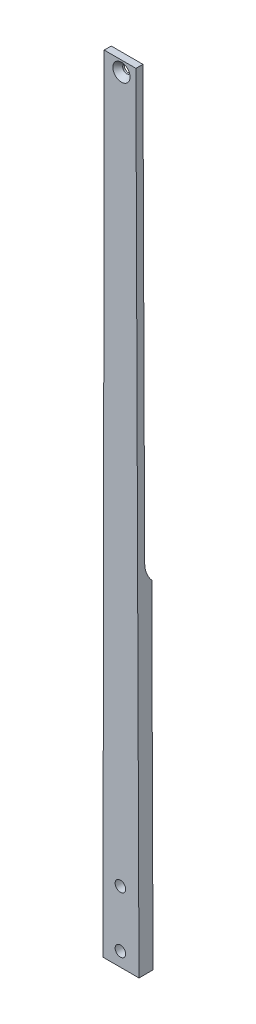
ISO-10303-21;
HEADER;
FILE_DESCRIPTION(('STEP AP214'),'2;1');
FILE_NAME('part.step','',(''),(''),'','','');
FILE_SCHEMA(('AUTOMOTIVE_DESIGN { 1 0 10303 214 1 1 1 1 }'));
ENDSEC;
DATA;
#1=APPLICATION_CONTEXT('core data for automotive mechanical design processes');
#2=APPLICATION_PROTOCOL_DEFINITION('international standard','automotive_design',2000,#1);
#3=PRODUCT_CONTEXT('',#1,'mechanical');
#4=PRODUCT('Part','Part','',(#3));
#5=PRODUCT_RELATED_PRODUCT_CATEGORY('part','',(#4));
#6=PRODUCT_DEFINITION_FORMATION('','',#4);
#7=PRODUCT_DEFINITION_CONTEXT('part definition',#1,'design');
#8=PRODUCT_DEFINITION('design','',#6,#7);
#9=PRODUCT_DEFINITION_SHAPE('','',#8);
#10=(LENGTH_UNIT() NAMED_UNIT(*) SI_UNIT(.MILLI.,.METRE.));
#11=(NAMED_UNIT(*) PLANE_ANGLE_UNIT() SI_UNIT($,.RADIAN.));
#12=(NAMED_UNIT(*) SI_UNIT($,.STERADIAN.) SOLID_ANGLE_UNIT());
#13=UNCERTAINTY_MEASURE_WITH_UNIT(LENGTH_MEASURE(1.E-05),#10,'distance_accuracy_value','');
#14=(GEOMETRIC_REPRESENTATION_CONTEXT(3) GLOBAL_UNCERTAINTY_ASSIGNED_CONTEXT((#13)) GLOBAL_UNIT_ASSIGNED_CONTEXT((#10,
#11,#12)) REPRESENTATION_CONTEXT('',''));
#15=CARTESIAN_POINT('',(0.,0.,0.));
#16=DIRECTION('',(0.,0.,1.));
#17=DIRECTION('',(1.,0.,0.));
#18=AXIS2_PLACEMENT_3D('',#15,#16,#17);
#19=CARTESIAN_POINT('',(-5.28708449601715,399.996,-6.35));
#20=DIRECTION('',(0.,-1.,0.));
#21=DIRECTION('',(1.,0.,0.));
#22=AXIS2_PLACEMENT_3D('',#19,#20,#21);
#23=PLANE('',#22);
#24=DIRECTION('',(-1.,0.,0.));
#25=VECTOR('',#24,1.);
#26=CARTESIAN_POINT('',(-35.5509106008114,399.996,-3.175));
#27=LINE('',#26,#25);
#28=CARTESIAN_POINT('',(9.04641692880041,399.996,-3.175));
#29=VERTEX_POINT('',#28);
#30=CARTESIAN_POINT('',(-5.28708449601715,399.996,-3.175));
#31=VERTEX_POINT('',#30);
#32=EDGE_CURVE('E102',#29,#31,#27,.T.);
#33=ORIENTED_EDGE('',*,*,#32,.T.);
#34=DIRECTION('',(0.,0.,1.));
#35=VECTOR('',#34,1.);
#36=CARTESIAN_POINT('',(-5.28708449601715,399.996,-6.35));
#37=LINE('',#36,#35);
#38=CARTESIAN_POINT('',(-5.28708449601715,399.996,0.));
#39=VERTEX_POINT('',#38);
#40=EDGE_CURVE('E111',#31,#39,#37,.T.);
#41=ORIENTED_EDGE('',*,*,#40,.T.);
#42=DIRECTION('',(-1.,0.,0.));
#43=VECTOR('',#42,1.);
#44=CARTESIAN_POINT('',(-5.28708449601715,399.996,0.));
#45=LINE('',#44,#43);
#46=CARTESIAN_POINT('',(9.04641692880041,399.996,0.));
#47=VERTEX_POINT('',#46);
#48=EDGE_CURVE('E114',#47,#39,#45,.T.);
#49=ORIENTED_EDGE('',*,*,#48,.F.);
#50=DIRECTION('',(0.,0.,1.));
#51=VECTOR('',#50,1.);
#52=CARTESIAN_POINT('',(9.04641692880041,399.996,-6.35));
#53=LINE('',#52,#51);
#54=EDGE_CURVE('E150',#29,#47,#53,.T.);
#55=ORIENTED_EDGE('',*,*,#54,.F.);
#56=EDGE_LOOP('',(#33,#41,#49,#55));
#57=FACE_BOUND('',#56,.T.);
#58=ADVANCED_FACE('F37',(#57),#23,.F.);
#59=CARTESIAN_POINT('',(2.51217831596574,395.2335,0.));
#60=DIRECTION('',(0.,0.,1.));
#61=DIRECTION('',(-1.,0.,0.));
#62=AXIS2_PLACEMENT_3D('',#59,#60,#61);
#63=CYLINDRICAL_SURFACE('',#62,1.8288);
#64=CARTESIAN_POINT('',(2.51217831596574,395.2335,-2.38137763978821));
#65=DIRECTION('',(0.,0.,-1.));
#66=DIRECTION('',(-1.,0.,0.));
#67=AXIS2_PLACEMENT_3D('',#64,#65,#66);
#68=CIRCLE('',#67,1.8288);
#69=CARTESIAN_POINT('',(0.683378315965738,395.2335,-2.38137763978821));
#70=VERTEX_POINT('',#69);
#71=EDGE_CURVE('E182',#70,#70,#68,.T.);
#72=ORIENTED_EDGE('',*,*,#71,.F.);
#73=EDGE_LOOP('',(#72));
#74=FACE_BOUND('',#73,.T.);
#75=CARTESIAN_POINT('',(2.51217831596574,395.2335,-3.175));
#76=DIRECTION('',(0.,0.,1.));
#77=DIRECTION('',(1.,0.,0.));
#78=AXIS2_PLACEMENT_3D('',#75,#76,#77);
#79=CIRCLE('',#78,1.8288);
#80=CARTESIAN_POINT('',(4.34097831596574,395.2335,-3.175));
#81=VERTEX_POINT('',#80);
#82=EDGE_CURVE('E140',#81,#81,#79,.F.);
#83=ORIENTED_EDGE('',*,*,#82,.T.);
#84=EDGE_LOOP('',(#83));
#85=FACE_BOUND('',#84,.T.);
#86=ADVANCED_FACE('F132',(#74,#85),#63,.F.);
#87=CARTESIAN_POINT('',(10.4977022260614,29.9643245872979,-6.35));
#88=CARTESIAN_POINT('',(10.3579391680048,67.7989887250294,-6.35));
#89=CARTESIAN_POINT('',(10.0201544794482,157.80257599493,-6.35));
#90=CARTESIAN_POINT('',(9.66771500819669,247.806107418328,-6.35));
#91=CARTESIAN_POINT('',(9.3229525056798,333.315331774466,-6.35));
#92=CARTESIAN_POINT('',(9.18606411784086,366.655671710222,-6.35));
#93=CARTESIAN_POINT('',(9.04641692880041,399.996,-6.35));
#94=B_SPLINE_CURVE_WITH_KNOTS('',3,(#87,#88,#89,#90,#91,#92,#93),.UNSPECIFIED.,.F.,.F.,(4,1,2,
4),(0.,0.306741017504105,0.729695864545239,1.),.UNSPECIFIED.);
#95=DIRECTION('',(0.,0.,1.));
#96=VECTOR('',#95,1.);
#97=SURFACE_OF_LINEAR_EXTRUSION('',#94,#96);
#98=CARTESIAN_POINT('',(10.4977022260614,29.9643245872979,-3.175));
#99=CARTESIAN_POINT('',(10.3579391680048,67.7989887250294,-3.175));
#100=CARTESIAN_POINT('',(10.0201544794482,157.80257599493,-3.175));
#101=CARTESIAN_POINT('',(9.66771500819669,247.806107418328,-3.175));
#102=CARTESIAN_POINT('',(9.3229525056798,333.315331774466,-3.175));
#103=CARTESIAN_POINT('',(9.18606411784086,366.655671710222,-3.175));
#104=CARTESIAN_POINT('',(9.04641692880041,399.996,-3.175));
#105=B_SPLINE_CURVE_WITH_KNOTS('',3,(#98,#99,#100,#101,#102,#103,#104),.UNSPECIFIED.,.F.,.F.,(4,
1,2,4),(0.,0.306741017504105,0.729695864545239,1.),.UNSPECIFIED.);
#106=CARTESIAN_POINT('',(9.83310345516962,205.19626041263,-3.175));
#107=VERTEX_POINT('',#106);
#108=EDGE_CURVE('E188',#107,#29,#105,.T.);
#109=ORIENTED_EDGE('',*,*,#108,.T.);
#110=ORIENTED_EDGE('',*,*,#54,.T.);
#111=CARTESIAN_POINT('',(10.4977022260614,29.9643245872979,0.));
#112=CARTESIAN_POINT('',(10.3579391680048,67.7989887250294,0.));
#113=CARTESIAN_POINT('',(10.0201544794482,157.80257599493,0.));
#114=CARTESIAN_POINT('',(9.66771500819669,247.806107418328,0.));
#115=CARTESIAN_POINT('',(9.3229525056798,333.315331774466,0.));
#116=CARTESIAN_POINT('',(9.18606411784086,366.655671710222,0.));
#117=CARTESIAN_POINT('',(9.04641692880041,399.996,0.));
#118=B_SPLINE_CURVE_WITH_KNOTS('',3,(#111,#112,#113,#114,#115,#116,#117),.UNSPECIFIED.,.F.,.F.,
(4,1,2,4),(0.,0.306741017504105,0.729695864545239,1.),.UNSPECIFIED.);
#119=CARTESIAN_POINT('',(10.4440816928599,44.45,0.));
#120=VERTEX_POINT('',#119);
#121=EDGE_CURVE('E161',#120,#47,#118,.T.);
#122=ORIENTED_EDGE('',*,*,#121,.F.);
#123=DIRECTION('',(0.,0.,1.));
#124=VECTOR('',#123,1.);
#125=CARTESIAN_POINT('',(10.4440816928599,44.45,-6.35));
#126=LINE('',#125,#124);
#127=CARTESIAN_POINT('',(10.4440816928599,44.45,-6.35));
#128=VERTEX_POINT('',#127);
#129=EDGE_CURVE('E108',#128,#120,#126,.T.);
#130=ORIENTED_EDGE('',*,*,#129,.F.);
#131=CARTESIAN_POINT('',(9.86581217806057,196.796,-6.35));
#132=VERTEX_POINT('',#131);
#133=EDGE_CURVE('E97',#128,#132,#94,.T.);
#134=ORIENTED_EDGE('',*,*,#133,.T.);
#135=CARTESIAN_POINT('',(9.83310345513582,205.19626041263,-3.175));
#136=CARTESIAN_POINT('',(9.83403087909923,204.958415509531,-3.17499247087948));
#137=CARTESIAN_POINT('',(9.83495818721562,204.720571438755,-3.18168124047176));
#138=CARTESIAN_POINT('',(9.83680965387325,204.245634259718,-3.20839712795122));
#139=CARTESIAN_POINT('',(9.83773381242488,204.008541148978,-3.2284242017747));
#140=CARTESIAN_POINT('',(9.83957607416271,203.535852086352,-3.28176262079115));
#141=CARTESIAN_POINT('',(9.84049417730992,203.300256144104,-3.3150740514291));
#142=CARTESIAN_POINT('',(9.84232291490128,202.830925481324,-3.3949381616698));
#143=CARTESIAN_POINT('',(9.84323353475041,202.597194415948,-3.44151231306713));
#144=CARTESIAN_POINT('',(9.84504290061525,202.132725845167,-3.54773335974519));
#145=CARTESIAN_POINT('',(9.84594164701047,201.901988244092,-3.60737983613853));
#146=CARTESIAN_POINT('',(9.84772435028309,201.444257575011,-3.739546412053));
#147=CARTESIAN_POINT('',(9.84860830790293,201.21726431904,-3.81206586318933));
#148=CARTESIAN_POINT('',(9.85079718801886,200.655114239211,-4.00926167887641));
#149=CARTESIAN_POINT('',(9.85209128762189,200.322705029697,-4.14187272721175));
#150=CARTESIAN_POINT('',(9.8546309599013,199.670246150278,-4.43467368466598));
#151=CARTESIAN_POINT('',(9.8558765267388,199.350197967542,-4.59486689965228));
#152=CARTESIAN_POINT('',(9.85830705469773,198.725578126764,-4.94122304297471));
#153=CARTESIAN_POINT('',(9.8594921651959,198.420968336657,-5.12731725725638));
#154=CARTESIAN_POINT('',(9.86179638689621,197.828626729997,-5.52439724126177));
#155=CARTESIAN_POINT('',(9.86291553916851,197.540884411198,-5.73536727064338));
#156=CARTESIAN_POINT('',(9.86430631255106,197.18325794127,-6.02146583437368));
#157=CARTESIAN_POINT('',(9.86461192092945,197.104669978291,-6.08589897004978));
#158=CARTESIAN_POINT('',(9.86521677953916,196.94912305434,-6.21658257289285));
#159=CARTESIAN_POINT('',(9.86551603448512,196.872162885615,-6.28283160249194));
#160=CARTESIAN_POINT('',(9.86581217806057,196.796,-6.34999999999999));
#161=B_SPLINE_CURVE_WITH_KNOTS('',3,(#135,#136,#137,#138,#139,#140,#141,#142,#143,#144,#145,
#146,#147,#148,#149,#150,#151,#152,#153,#154,#155,#156,#157,#158,#159,#160),.UNSPECIFIED.,.F.,
.F.,(4,2,2,2,2,2,2,2,2,2,2,2,4),(0.,0.713444861550316,1.42688736621422,2.14033445981421,
2.85494322615147,3.56952909703283,4.28407898592627,5.35639076364407,6.42883115313344,
7.49847880061246,8.56745321710063,8.87231133920578,9.17693471733898),.UNSPECIFIED.);
#162=EDGE_CURVE('E51',#107,#132,#161,.T.);
#163=ORIENTED_EDGE('',*,*,#162,.F.);
#164=EDGE_LOOP('',(#109,#110,#122,#130,#134,#163));
#165=FACE_BOUND('',#164,.T.);
#166=ADVANCED_FACE('F105',(#165),#97,.T.);
#167=CARTESIAN_POINT('',(-5.28708449601715,399.996,-6.35));
#168=CARTESIAN_POINT('',(-5.39197549250737,338.602231380514,-6.35));
#169=CARTESIAN_POINT('',(-5.52953849339023,254.095503007995,-6.35));
#170=CARTESIAN_POINT('',(-5.71814315412126,131.164770272772,-6.35));
#171=CARTESIAN_POINT('',(-5.80863152532558,69.6278175841326,-6.35));
#172=CARTESIAN_POINT('',(-5.86379750654596,31.2038199392675,-6.35));
#173=B_SPLINE_CURVE_WITH_KNOTS('',3,(#167,#168,#169,#170,#171,#172),.UNSPECIFIED.,.F.,.F.,(4,1,
1,4),(0.,0.499417717587248,0.68743379950888,1.),.UNSPECIFIED.);
#174=DIRECTION('',(0.,0.,1.));
#175=VECTOR('',#174,1.);
#176=SURFACE_OF_LINEAR_EXTRUSION('',#173,#175);
#177=CARTESIAN_POINT('',(-5.61721184025603,196.796,-6.35));
#178=VERTEX_POINT('',#177);
#179=CARTESIAN_POINT('',(-5.84472654488417,44.45,-6.35));
#180=VERTEX_POINT('',#179);
#181=EDGE_CURVE('E100',#178,#180,#173,.T.);
#182=ORIENTED_EDGE('',*,*,#181,.T.);
#183=DIRECTION('',(0.,0.,1.));
#184=VECTOR('',#183,1.);
#185=CARTESIAN_POINT('',(-5.84472654488613,44.45,-6.35));
#186=LINE('',#185,#184);
#187=CARTESIAN_POINT('',(-5.84472654488417,44.4500000013556,0.));
#188=VERTEX_POINT('',#187);
#189=EDGE_CURVE('E168',#188,#180,#186,.F.);
#190=ORIENTED_EDGE('',*,*,#189,.F.);
#191=CARTESIAN_POINT('',(-5.28708449601715,399.996,0.));
#192=CARTESIAN_POINT('',(-5.39197549250737,338.602231380514,0.));
#193=CARTESIAN_POINT('',(-5.52953849339023,254.095503007995,0.));
#194=CARTESIAN_POINT('',(-5.71814315412126,131.164770272772,0.));
#195=CARTESIAN_POINT('',(-5.80863152532558,69.6278175841326,0.));
#196=CARTESIAN_POINT('',(-5.86379750654596,31.2038199392675,0.));
#197=B_SPLINE_CURVE_WITH_KNOTS('',3,(#191,#192,#193,#194,#195,#196),.UNSPECIFIED.,.F.,.F.,(4,1,
1,4),(0.,0.499417717587248,0.68743379950888,1.),.UNSPECIFIED.);
#198=EDGE_CURVE('E109',#39,#188,#197,.T.);
#199=ORIENTED_EDGE('',*,*,#198,.F.);
#200=ORIENTED_EDGE('',*,*,#40,.F.);
#201=CARTESIAN_POINT('',(-5.28708449601715,399.996,-3.175));
#202=CARTESIAN_POINT('',(-5.39197549250737,338.602231380514,-3.175));
#203=CARTESIAN_POINT('',(-5.52953849339023,254.095503007995,-3.175));
#204=CARTESIAN_POINT('',(-5.71814315412126,131.164770272772,-3.175));
#205=CARTESIAN_POINT('',(-5.80863152532558,69.6278175841326,-3.175));
#206=CARTESIAN_POINT('',(-5.86379750654596,31.2038199392675,-3.175));
#207=B_SPLINE_CURVE_WITH_KNOTS('',3,(#201,#202,#203,#204,#205,#206),.UNSPECIFIED.,.F.,.F.,(4,1,
1,4),(0.,0.499417717587248,0.68743379950888,1.),.UNSPECIFIED.);
#208=CARTESIAN_POINT('',(-5.60420008435778,205.19626041263,-3.175));
#209=VERTEX_POINT('',#208);
#210=EDGE_CURVE('E143',#31,#209,#207,.T.);
#211=ORIENTED_EDGE('',*,*,#210,.T.);
#212=CARTESIAN_POINT('',(-5.61721184025603,196.796,-6.35));
#213=CARTESIAN_POINT('',(-5.61693608310515,196.974377902398,-6.19267543773624));
#214=CARTESIAN_POINT('',(-5.61665344504512,197.157184320282,-6.040373611593));
#215=CARTESIAN_POINT('',(-5.61607532162393,197.531056323594,-5.74627035829035));
#216=CARTESIAN_POINT('',(-5.61577983630551,197.722121881548,-5.60446889620736));
#217=CARTESIAN_POINT('',(-5.61517692910145,198.111916748259,-5.33181936933783));
#218=CARTESIAN_POINT('',(-5.61486950713914,198.310646106244,-5.20097137492866));
#219=CARTESIAN_POINT('',(-5.61424318352235,198.715466996848,-4.95043735737793));
#220=CARTESIAN_POINT('',(-5.61392426399462,198.921569987803,-4.83076985173149));
#221=CARTESIAN_POINT('',(-5.61327642223252,199.340177499266,-4.60321934396371));
#222=CARTESIAN_POINT('',(-5.61294750031891,199.552681814496,-4.49533596446133));
#223=CARTESIAN_POINT('',(-5.61228072099003,199.983397037189,-4.29170108053239));
#224=CARTESIAN_POINT('',(-5.61194286402551,200.201607656775,-4.19594896551751));
#225=CARTESIAN_POINT('',(-5.61108799952469,200.75364923563,-3.97201890979975));
#226=CARTESIAN_POINT('',(-5.61056598922691,201.09066771392,-3.85160927357716));
#227=CARTESIAN_POINT('',(-5.60950781325277,201.773676479233,-3.63964886696507));
#228=CARTESIAN_POINT('',(-5.60897164588608,202.119667837519,-3.5481015597469));
#229=CARTESIAN_POINT('',(-5.6078904103516,202.817220356157,-3.39472057993135));
#230=CARTESIAN_POINT('',(-5.60734536899653,203.168764667031,-3.33281015533952));
#231=CARTESIAN_POINT('',(-5.60624911012439,203.875658851902,-3.23882126083724));
#232=CARTESIAN_POINT('',(-5.60569789671033,204.23100619153,-3.20672404002061));
#233=CARTESIAN_POINT('',(-5.60498810424915,204.688468214795,-3.18474810991549));
#234=CARTESIAN_POINT('',(-5.60483050086139,204.79003647606,-3.18109127846491));
#235=CARTESIAN_POINT('',(-5.60451530205358,204.993153280969,-3.17621852005121));
#236=CARTESIAN_POINT('',(-5.60435770672086,205.094701779563,-3.17500071554446));
#237=CARTESIAN_POINT('',(-5.60420008435778,205.19626041263,-3.175));
#238=B_SPLINE_CURVE_WITH_KNOTS('',3,(#212,#213,#214,#215,#216,#217,#218,#219,#220,#221,#222,
#223,#224,#225,#226,#227,#228,#229,#230,#231,#232,#233,#234,#235,#236,#237),.UNSPECIFIED.,.F.,
.F.,(4,2,2,2,2,2,2,2,2,2,2,2,4),(0.,0.713436737987538,1.42687110302095,2.14031005160588,
2.85491041775407,3.56948789245234,4.28402938688344,5.35632844479902,6.42875611822762,
7.49839124665395,8.56735317551277,8.87223665778535,9.17688535282129),.UNSPECIFIED.);
#239=EDGE_CURVE('E11',#178,#209,#238,.T.);
#240=ORIENTED_EDGE('',*,*,#239,.F.);
#241=EDGE_LOOP('',(#182,#190,#199,#200,#211,#240));
#242=FACE_BOUND('',#241,.T.);
#243=ADVANCED_FACE('F131',(#242),#176,.T.);
#244=CARTESIAN_POINT('',(9.7948897232855,214.980252046994,-6.35));
#245=DIRECTION('',(0.,0.,1.));
#246=DIRECTION('',(-1.,0.,0.));
#247=AXIS2_PLACEMENT_3D('',#244,#245,#246);
#248=PLANE('',#247);
#249=CARTESIAN_POINT('',(2.032,50.8,-6.35));
#250=DIRECTION('',(0.,0.,1.));
#251=DIRECTION('',(1.,0.,0.));
#252=AXIS2_PLACEMENT_3D('',#249,#250,#251);
#253=CIRCLE('',#252,2.38125);
#254=CARTESIAN_POINT('',(4.41325,50.8,-6.35));
#255=VERTEX_POINT('',#254);
#256=EDGE_CURVE('E179',#255,#255,#253,.T.);
#257=ORIENTED_EDGE('',*,*,#256,.T.);
#258=EDGE_LOOP('',(#257));
#259=FACE_BOUND('',#258,.T.);
#260=CARTESIAN_POINT('',(2.03199999999999,76.2,-6.35));
#261=DIRECTION('',(0.,0.,1.));
#262=DIRECTION('',(1.,0.,0.));
#263=AXIS2_PLACEMENT_3D('',#260,#261,#262);
#264=CIRCLE('',#263,2.38125);
#265=CARTESIAN_POINT('',(4.41324999999999,76.2,-6.35));
#266=VERTEX_POINT('',#265);
#267=EDGE_CURVE('E148',#266,#266,#264,.T.);
#268=ORIENTED_EDGE('',*,*,#267,.T.);
#269=EDGE_LOOP('',(#268));
#270=FACE_BOUND('',#269,.T.);
#271=ORIENTED_EDGE('',*,*,#133,.F.);
#272=DIRECTION('',(-1.,0.,0.));
#273=VECTOR('',#272,1.);
#274=CARTESIAN_POINT('',(-9.398,44.45,-6.35));
#275=LINE('',#274,#273);
#276=EDGE_CURVE('E147',#128,#180,#275,.T.);
#277=ORIENTED_EDGE('',*,*,#276,.T.);
#278=ORIENTED_EDGE('',*,*,#181,.F.);
#279=DIRECTION('',(1.,0.,0.));
#280=VECTOR('',#279,1.);
#281=CARTESIAN_POINT('',(-35.5509106008114,196.796,-6.35));
#282=LINE('',#281,#280);
#283=EDGE_CURVE('E94',#178,#132,#282,.T.);
#284=ORIENTED_EDGE('',*,*,#283,.T.);
#285=EDGE_LOOP('',(#271,#277,#278,#284));
#286=FACE_BOUND('',#285,.T.);
#287=ADVANCED_FACE('F95',(#259,#270,#286),#248,.F.);
#288=CARTESIAN_POINT('',(9.7948897232855,214.980252046994,0.));
#289=DIRECTION('',(0.,0.,1.));
#290=DIRECTION('',(-1.,0.,0.));
#291=AXIS2_PLACEMENT_3D('',#288,#289,#290);
#292=PLANE('',#291);
#293=CARTESIAN_POINT('',(2.51217831596574,395.2335,0.));
#294=DIRECTION('',(0.,0.,-1.));
#295=DIRECTION('',(-1.,0.,0.));
#296=AXIS2_PLACEMENT_3D('',#293,#294,#295);
#297=CIRCLE('',#296,3.8989);
#298=CARTESIAN_POINT('',(-1.38672168403426,395.2335,0.));
#299=VERTEX_POINT('',#298);
#300=EDGE_CURVE('E185',#299,#299,#297,.T.);
#301=ORIENTED_EDGE('',*,*,#300,.T.);
#302=EDGE_LOOP('',(#301));
#303=FACE_BOUND('',#302,.T.);
#304=CARTESIAN_POINT('',(2.032,50.8,0.));
#305=DIRECTION('',(0.,0.,-1.));
#306=DIRECTION('',(-1.,0.,0.));
#307=AXIS2_PLACEMENT_3D('',#304,#305,#306);
#308=CIRCLE('',#307,2.38125);
#309=CARTESIAN_POINT('',(-0.349249999999997,50.8,0.));
#310=VERTEX_POINT('',#309);
#311=EDGE_CURVE('E176',#310,#310,#308,.T.);
#312=ORIENTED_EDGE('',*,*,#311,.T.);
#313=EDGE_LOOP('',(#312));
#314=FACE_BOUND('',#313,.T.);
#315=CARTESIAN_POINT('',(2.03199999999999,76.2,0.));
#316=DIRECTION('',(0.,0.,-1.));
#317=DIRECTION('',(-1.,0.,0.));
#318=AXIS2_PLACEMENT_3D('',#315,#316,#317);
#319=CIRCLE('',#318,2.38125);
#320=CARTESIAN_POINT('',(-0.349250000000003,76.2,0.));
#321=VERTEX_POINT('',#320);
#322=EDGE_CURVE('E144',#321,#321,#319,.T.);
#323=ORIENTED_EDGE('',*,*,#322,.T.);
#324=EDGE_LOOP('',(#323));
#325=FACE_BOUND('',#324,.T.);
#326=DIRECTION('',(1.,0.,0.));
#327=VECTOR('',#326,1.);
#328=CARTESIAN_POINT('',(9.7948897232855,44.45,0.));
#329=LINE('',#328,#327);
#330=EDGE_CURVE('E139',#188,#120,#329,.T.);
#331=ORIENTED_EDGE('',*,*,#330,.T.);
#332=ORIENTED_EDGE('',*,*,#121,.T.);
#333=ORIENTED_EDGE('',*,*,#48,.T.);
#334=ORIENTED_EDGE('',*,*,#198,.T.);
#335=EDGE_LOOP('',(#331,#332,#333,#334));
#336=FACE_BOUND('',#335,.T.);
#337=ADVANCED_FACE('F210',(#303,#314,#325,#336),#292,.T.);
#338=CARTESIAN_POINT('',(-9.398,44.45,1.2E-05));
#339=DIRECTION('',(0.,1.,0.));
#340=DIRECTION('',(0.,0.,-1.));
#341=AXIS2_PLACEMENT_3D('',#338,#339,#340);
#342=PLANE('',#341);
#343=ORIENTED_EDGE('',*,*,#276,.F.);
#344=ORIENTED_EDGE('',*,*,#129,.T.);
#345=ORIENTED_EDGE('',*,*,#330,.F.);
#346=ORIENTED_EDGE('',*,*,#189,.T.);
#347=EDGE_LOOP('',(#343,#344,#345,#346));
#348=FACE_BOUND('',#347,.T.);
#349=ADVANCED_FACE('F212',(#348),#342,.F.);
#350=CARTESIAN_POINT('',(2.03199999999999,76.2,-6.35));
#351=DIRECTION('',(0.,0.,-1.));
#352=DIRECTION('',(1.,0.,0.));
#353=AXIS2_PLACEMENT_3D('',#350,#351,#352);
#354=CYLINDRICAL_SURFACE('',#353,2.38125);
#355=ORIENTED_EDGE('',*,*,#322,.F.);
#356=EDGE_LOOP('',(#355));
#357=FACE_BOUND('',#356,.T.);
#358=ORIENTED_EDGE('',*,*,#267,.F.);
#359=EDGE_LOOP('',(#358));
#360=FACE_BOUND('',#359,.T.);
#361=ADVANCED_FACE('F219',(#357,#360),#354,.F.);
#362=CARTESIAN_POINT('',(2.032,50.8,-6.35));
#363=DIRECTION('',(0.,0.,-1.));
#364=DIRECTION('',(1.,0.,0.));
#365=AXIS2_PLACEMENT_3D('',#362,#363,#364);
#366=CYLINDRICAL_SURFACE('',#365,2.38125);
#367=ORIENTED_EDGE('',*,*,#311,.F.);
#368=EDGE_LOOP('',(#367));
#369=FACE_BOUND('',#368,.T.);
#370=ORIENTED_EDGE('',*,*,#256,.F.);
#371=EDGE_LOOP('',(#370));
#372=FACE_BOUND('',#371,.T.);
#373=ADVANCED_FACE('F238',(#369,#372),#366,.F.);
#374=CARTESIAN_POINT('',(2.51217831596574,395.2335,0.));
#375=DIRECTION('',(0.,0.,1.));
#376=DIRECTION('',(-1.,0.,0.));
#377=AXIS2_PLACEMENT_3D('',#374,#375,#376);
#378=CONICAL_SURFACE('',#377,3.8989,0.715584993317675);
#379=ORIENTED_EDGE('',*,*,#71,.T.);
#380=EDGE_LOOP('',(#379));
#381=FACE_BOUND('',#380,.T.);
#382=ORIENTED_EDGE('',*,*,#300,.F.);
#383=EDGE_LOOP('',(#382));
#384=FACE_BOUND('',#383,.T.);
#385=ADVANCED_FACE('F236',(#381,#384),#378,.F.);
#386=CARTESIAN_POINT('',(0.,0.,-3.175));
#387=DIRECTION('',(0.,0.,-1.));
#388=DIRECTION('',(1.,0.,0.));
#389=AXIS2_PLACEMENT_3D('',#386,#387,#388);
#390=PLANE('',#389);
#391=ORIENTED_EDGE('',*,*,#82,.F.);
#392=EDGE_LOOP('',(#391));
#393=FACE_BOUND('',#392,.T.);
#394=ORIENTED_EDGE('',*,*,#210,.F.);
#395=ORIENTED_EDGE('',*,*,#32,.F.);
#396=ORIENTED_EDGE('',*,*,#108,.F.);
#397=DIRECTION('',(-1.,0.,0.));
#398=VECTOR('',#397,1.);
#399=CARTESIAN_POINT('',(9.86581217806057,205.19626041263,-3.175));
#400=LINE('',#399,#398);
#401=EDGE_CURVE('E58',#209,#107,#400,.F.);
#402=ORIENTED_EDGE('',*,*,#401,.F.);
#403=EDGE_LOOP('',(#394,#395,#396,#402));
#404=FACE_BOUND('',#403,.T.);
#405=ADVANCED_FACE('F208',(#393,#404),#390,.T.);
#406=CARTESIAN_POINT('',(-35.5509106008114,205.19626041263,-15.875));
#407=DIRECTION('',(1.,0.,0.));
#408=DIRECTION('',(0.,0.,1.));
#409=AXIS2_PLACEMENT_3D('',#406,#407,#408);
#410=CYLINDRICAL_SURFACE('',#409,12.7);
#411=ORIENTED_EDGE('',*,*,#239,.T.);
#412=ORIENTED_EDGE('',*,*,#401,.T.);
#413=ORIENTED_EDGE('',*,*,#162,.T.);
#414=ORIENTED_EDGE('',*,*,#283,.F.);
#415=EDGE_LOOP('',(#411,#412,#413,#414));
#416=FACE_BOUND('',#415,.T.);
#417=ADVANCED_FACE('F39',(#416),#410,.F.);
#418=CLOSED_SHELL('',(#58,#86,#166,#243,#287,#337,#349,#361,#373,#385,#405,#417));
#419=MANIFOLD_SOLID_BREP('B2',#418);
#420=ADVANCED_BREP_SHAPE_REPRESENTATION('',(#18,#419),#14);
#421=SHAPE_DEFINITION_REPRESENTATION(#9,#420);
ENDSEC;
END-ISO-10303-21;
